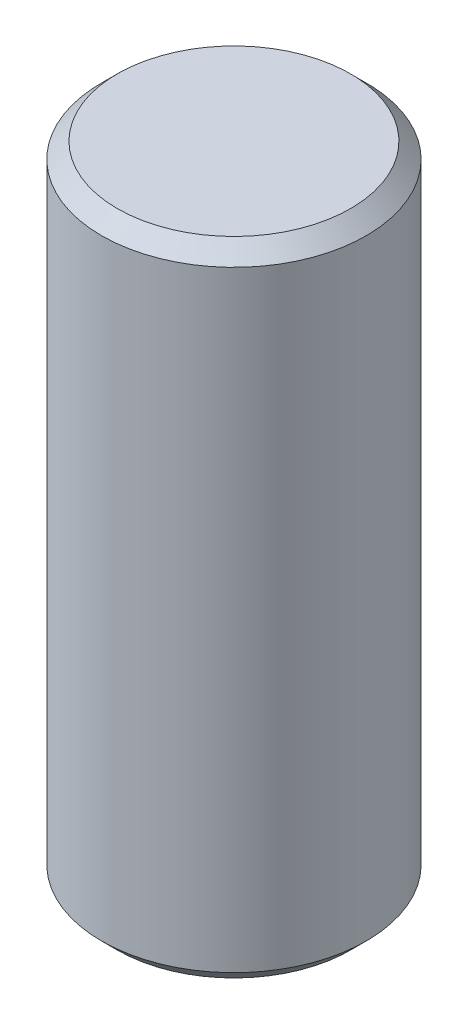
ISO-10303-21;
HEADER;
FILE_DESCRIPTION(('STEP AP214'),'2;1');
FILE_NAME('part.step','',(''),(''),'','','');
FILE_SCHEMA(('AUTOMOTIVE_DESIGN { 1 0 10303 214 1 1 1 1 }'));
ENDSEC;
DATA;
#1=APPLICATION_CONTEXT('core data for automotive mechanical design processes');
#2=APPLICATION_PROTOCOL_DEFINITION('international standard','automotive_design',2000,#1);
#3=PRODUCT_CONTEXT('',#1,'mechanical');
#4=PRODUCT('Part','Part','',(#3));
#5=PRODUCT_RELATED_PRODUCT_CATEGORY('part','',(#4));
#6=PRODUCT_DEFINITION_FORMATION('','',#4);
#7=PRODUCT_DEFINITION_CONTEXT('part definition',#1,'design');
#8=PRODUCT_DEFINITION('design','',#6,#7);
#9=PRODUCT_DEFINITION_SHAPE('','',#8);
#10=(LENGTH_UNIT() NAMED_UNIT(*) SI_UNIT(.MILLI.,.METRE.));
#11=(NAMED_UNIT(*) PLANE_ANGLE_UNIT() SI_UNIT($,.RADIAN.));
#12=(NAMED_UNIT(*) SI_UNIT($,.STERADIAN.) SOLID_ANGLE_UNIT());
#13=UNCERTAINTY_MEASURE_WITH_UNIT(LENGTH_MEASURE(1.E-05),#10,'distance_accuracy_value','');
#14=(GEOMETRIC_REPRESENTATION_CONTEXT(3) GLOBAL_UNCERTAINTY_ASSIGNED_CONTEXT((#13)) GLOBAL_UNIT_ASSIGNED_CONTEXT((#10,
#11,#12)) REPRESENTATION_CONTEXT('',''));
#15=CARTESIAN_POINT('',(0.,0.,0.));
#16=DIRECTION('',(0.,0.,1.));
#17=DIRECTION('',(1.,0.,0.));
#18=AXIS2_PLACEMENT_3D('',#15,#16,#17);
#19=CARTESIAN_POINT('',(0.,2082.8,0.));
#20=DIRECTION('',(0.,-1.,0.));
#21=DIRECTION('',(0.,0.,-1.));
#22=AXIS2_PLACEMENT_3D('',#19,#20,#21);
#23=CYLINDRICAL_SURFACE('',#22,429.26);
#24=CARTESIAN_POINT('',(0.,50.7999999999997,0.));
#25=DIRECTION('',(0.,1.,0.));
#26=DIRECTION('',(0.,0.,1.));
#27=AXIS2_PLACEMENT_3D('',#24,#25,#26);
#28=CIRCLE('',#27,429.26);
#29=CARTESIAN_POINT('',(0.,50.7999999999997,429.26));
#30=VERTEX_POINT('',#29);
#31=EDGE_CURVE('E57',#30,#30,#28,.T.);
#32=ORIENTED_EDGE('',*,*,#31,.T.);
#33=EDGE_LOOP('',(#32));
#34=FACE_BOUND('',#33,.T.);
#35=CARTESIAN_POINT('',(0.,2032.,0.));
#36=DIRECTION('',(0.,1.,0.));
#37=DIRECTION('',(0.,0.,1.));
#38=AXIS2_PLACEMENT_3D('',#35,#36,#37);
#39=CIRCLE('',#38,429.26);
#40=CARTESIAN_POINT('',(0.,2032.,429.26));
#41=VERTEX_POINT('',#40);
#42=EDGE_CURVE('E62',#41,#41,#39,.F.);
#43=ORIENTED_EDGE('',*,*,#42,.T.);
#44=EDGE_LOOP('',(#43));
#45=FACE_BOUND('',#44,.T.);
#46=ADVANCED_FACE('F43',(#34,#45),#23,.T.);
#47=CARTESIAN_POINT('',(0.,2082.8,0.));
#48=DIRECTION('',(0.,1.,0.));
#49=DIRECTION('',(0.,0.,1.));
#50=AXIS2_PLACEMENT_3D('',#47,#48,#49);
#51=PLANE('',#50);
#52=CARTESIAN_POINT('',(0.,2082.8,0.));
#53=DIRECTION('',(0.,1.,0.));
#54=DIRECTION('',(0.,0.,1.));
#55=AXIS2_PLACEMENT_3D('',#52,#53,#54);
#56=CIRCLE('',#55,378.46);
#57=CARTESIAN_POINT('',(0.,2082.8,378.46));
#58=VERTEX_POINT('',#57);
#59=EDGE_CURVE('E10',#58,#58,#56,.T.);
#60=ORIENTED_EDGE('',*,*,#59,.T.);
#61=EDGE_LOOP('',(#60));
#62=FACE_BOUND('',#61,.T.);
#63=ADVANCED_FACE('F79',(#62),#51,.T.);
#64=CARTESIAN_POINT('',(0.,0.,0.));
#65=DIRECTION('',(0.,1.,0.));
#66=DIRECTION('',(0.,0.,1.));
#67=AXIS2_PLACEMENT_3D('',#64,#65,#66);
#68=PLANE('',#67);
#69=CARTESIAN_POINT('',(0.,0.,0.));
#70=DIRECTION('',(0.,1.,0.));
#71=DIRECTION('',(0.,0.,1.));
#72=AXIS2_PLACEMENT_3D('',#69,#70,#71);
#73=CIRCLE('',#72,378.46);
#74=CARTESIAN_POINT('',(0.,0.,378.46));
#75=VERTEX_POINT('',#74);
#76=EDGE_CURVE('E52',#75,#75,#73,.F.);
#77=ORIENTED_EDGE('',*,*,#76,.T.);
#78=EDGE_LOOP('',(#77));
#79=FACE_BOUND('',#78,.T.);
#80=ADVANCED_FACE('F76',(#79),#68,.F.);
#81=CARTESIAN_POINT('',(0.,50.7999999999997,0.));
#82=DIRECTION('',(0.,1.,0.));
#83=DIRECTION('',(0.,0.,1.));
#84=AXIS2_PLACEMENT_3D('',#81,#82,#83);
#85=CONICAL_SURFACE('',#84,429.26,0.785398163397455);
#86=ORIENTED_EDGE('',*,*,#76,.F.);
#87=EDGE_LOOP('',(#86));
#88=FACE_BOUND('',#87,.T.);
#89=ORIENTED_EDGE('',*,*,#31,.F.);
#90=EDGE_LOOP('',(#89));
#91=FACE_BOUND('',#90,.T.);
#92=ADVANCED_FACE('F72',(#88,#91),#85,.T.);
#93=CARTESIAN_POINT('',(0.,2082.8,0.));
#94=DIRECTION('',(0.,-1.,0.));
#95=DIRECTION('',(0.,0.,-1.));
#96=AXIS2_PLACEMENT_3D('',#93,#94,#95);
#97=CONICAL_SURFACE('',#96,378.46,0.78539816339744);
#98=ORIENTED_EDGE('',*,*,#42,.F.);
#99=EDGE_LOOP('',(#98));
#100=FACE_BOUND('',#99,.T.);
#101=ORIENTED_EDGE('',*,*,#59,.F.);
#102=EDGE_LOOP('',(#101));
#103=FACE_BOUND('',#102,.T.);
#104=ADVANCED_FACE('F46',(#100,#103),#97,.T.);
#105=CLOSED_SHELL('',(#46,#63,#80,#92,#104));
#106=MANIFOLD_SOLID_BREP('B2',#105);
#107=ADVANCED_BREP_SHAPE_REPRESENTATION('',(#18,#106),#14);
#108=SHAPE_DEFINITION_REPRESENTATION(#9,#107);
ENDSEC;
END-ISO-10303-21;
